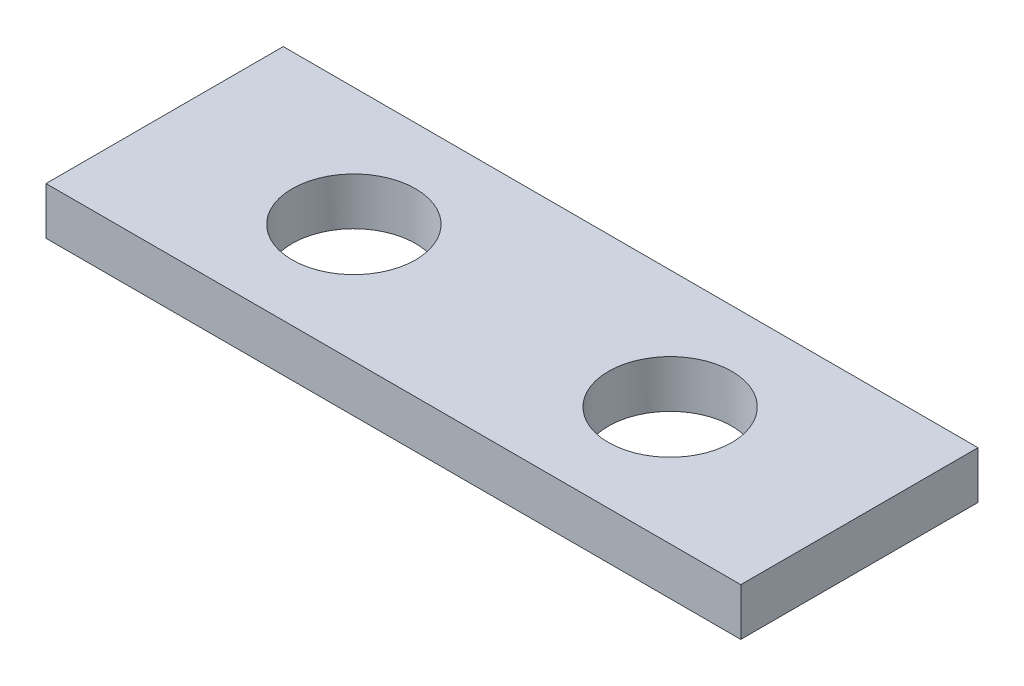
ISO-10303-21;
HEADER;
FILE_DESCRIPTION(('STEP AP214'),'2;1');
FILE_NAME('part.step','',(''),(''),'','','');
FILE_SCHEMA(('AUTOMOTIVE_DESIGN { 1 0 10303 214 1 1 1 1 }'));
ENDSEC;
DATA;
#1=APPLICATION_CONTEXT('core data for automotive mechanical design processes');
#2=APPLICATION_PROTOCOL_DEFINITION('international standard','automotive_design',2000,#1);
#3=PRODUCT_CONTEXT('',#1,'mechanical');
#4=PRODUCT('Part','Part','',(#3));
#5=PRODUCT_RELATED_PRODUCT_CATEGORY('part','',(#4));
#6=PRODUCT_DEFINITION_FORMATION('','',#4);
#7=PRODUCT_DEFINITION_CONTEXT('part definition',#1,'design');
#8=PRODUCT_DEFINITION('design','',#6,#7);
#9=PRODUCT_DEFINITION_SHAPE('','',#8);
#10=(LENGTH_UNIT() NAMED_UNIT(*) SI_UNIT(.MILLI.,.METRE.));
#11=(NAMED_UNIT(*) PLANE_ANGLE_UNIT() SI_UNIT($,.RADIAN.));
#12=(NAMED_UNIT(*) SI_UNIT($,.STERADIAN.) SOLID_ANGLE_UNIT());
#13=UNCERTAINTY_MEASURE_WITH_UNIT(LENGTH_MEASURE(1.E-05),#10,'distance_accuracy_value','');
#14=(GEOMETRIC_REPRESENTATION_CONTEXT(3) GLOBAL_UNCERTAINTY_ASSIGNED_CONTEXT((#13)) GLOBAL_UNIT_ASSIGNED_CONTEXT((#10,
#11,#12)) REPRESENTATION_CONTEXT('',''));
#15=CARTESIAN_POINT('',(0.,0.,0.));
#16=DIRECTION('',(0.,0.,1.));
#17=DIRECTION('',(1.,0.,0.));
#18=AXIS2_PLACEMENT_3D('',#15,#16,#17);
#19=CARTESIAN_POINT('',(21.965,3.,7.5));
#20=DIRECTION('',(-1.,0.,0.));
#21=DIRECTION('',(0.,0.,1.));
#22=AXIS2_PLACEMENT_3D('',#19,#20,#21);
#23=PLANE('',#22);
#24=DIRECTION('',(0.,0.,-1.));
#25=VECTOR('',#24,1.);
#26=CARTESIAN_POINT('',(21.965,0.,7.5));
#27=LINE('',#26,#25);
#28=CARTESIAN_POINT('',(21.965,0.,7.5));
#29=VERTEX_POINT('',#28);
#30=CARTESIAN_POINT('',(21.965,0.,-7.5));
#31=VERTEX_POINT('',#30);
#32=EDGE_CURVE('E96',#29,#31,#27,.T.);
#33=ORIENTED_EDGE('',*,*,#32,.T.);
#34=DIRECTION('',(0.,-1.,0.));
#35=VECTOR('',#34,1.);
#36=CARTESIAN_POINT('',(21.965,3.,-7.5));
#37=LINE('',#36,#35);
#38=CARTESIAN_POINT('',(21.965,3.,-7.5));
#39=VERTEX_POINT('',#38);
#40=EDGE_CURVE('E11',#39,#31,#37,.T.);
#41=ORIENTED_EDGE('',*,*,#40,.F.);
#42=DIRECTION('',(0.,0.,-1.));
#43=VECTOR('',#42,1.);
#44=CARTESIAN_POINT('',(21.965,3.,7.5));
#45=LINE('',#44,#43);
#46=CARTESIAN_POINT('',(21.965,3.,7.5));
#47=VERTEX_POINT('',#46);
#48=EDGE_CURVE('E84',#47,#39,#45,.T.);
#49=ORIENTED_EDGE('',*,*,#48,.F.);
#50=DIRECTION('',(0.,-1.,0.));
#51=VECTOR('',#50,1.);
#52=CARTESIAN_POINT('',(21.965,3.,7.5));
#53=LINE('',#52,#51);
#54=EDGE_CURVE('E92',#47,#29,#53,.T.);
#55=ORIENTED_EDGE('',*,*,#54,.T.);
#56=EDGE_LOOP('',(#33,#41,#49,#55));
#57=FACE_BOUND('',#56,.T.);
#58=ADVANCED_FACE('F33',(#57),#23,.F.);
#59=CARTESIAN_POINT('',(-21.965,3.,-7.5));
#60=DIRECTION('',(0.,0.,1.));
#61=DIRECTION('',(1.,0.,0.));
#62=AXIS2_PLACEMENT_3D('',#59,#60,#61);
#63=PLANE('',#62);
#64=DIRECTION('',(-1.,0.,0.));
#65=VECTOR('',#64,1.);
#66=CARTESIAN_POINT('',(-21.965,0.,-7.5));
#67=LINE('',#66,#65);
#68=CARTESIAN_POINT('',(-21.965,0.,-7.5));
#69=VERTEX_POINT('',#68);
#70=EDGE_CURVE('E88',#31,#69,#67,.T.);
#71=ORIENTED_EDGE('',*,*,#70,.T.);
#72=DIRECTION('',(0.,-1.,0.));
#73=VECTOR('',#72,1.);
#74=CARTESIAN_POINT('',(-21.965,3.,-7.5));
#75=LINE('',#74,#73);
#76=CARTESIAN_POINT('',(-21.965,3.,-7.5));
#77=VERTEX_POINT('',#76);
#78=EDGE_CURVE('E41',#77,#69,#75,.T.);
#79=ORIENTED_EDGE('',*,*,#78,.F.);
#80=DIRECTION('',(-1.,0.,0.));
#81=VECTOR('',#80,1.);
#82=CARTESIAN_POINT('',(-21.965,3.,-7.5));
#83=LINE('',#82,#81);
#84=EDGE_CURVE('E79',#39,#77,#83,.T.);
#85=ORIENTED_EDGE('',*,*,#84,.F.);
#86=ORIENTED_EDGE('',*,*,#40,.T.);
#87=EDGE_LOOP('',(#71,#79,#85,#86));
#88=FACE_BOUND('',#87,.T.);
#89=ADVANCED_FACE('F87',(#88),#63,.F.);
#90=CARTESIAN_POINT('',(-21.965,3.,7.5));
#91=DIRECTION('',(1.,0.,0.));
#92=DIRECTION('',(0.,0.,-1.));
#93=AXIS2_PLACEMENT_3D('',#90,#91,#92);
#94=PLANE('',#93);
#95=DIRECTION('',(0.,0.,1.));
#96=VECTOR('',#95,1.);
#97=CARTESIAN_POINT('',(-21.965,0.,7.5));
#98=LINE('',#97,#96);
#99=CARTESIAN_POINT('',(-21.965,0.,7.5));
#100=VERTEX_POINT('',#99);
#101=EDGE_CURVE('E66',#69,#100,#98,.T.);
#102=ORIENTED_EDGE('',*,*,#101,.T.);
#103=DIRECTION('',(0.,-1.,0.));
#104=VECTOR('',#103,1.);
#105=CARTESIAN_POINT('',(-21.965,3.,7.5));
#106=LINE('',#105,#104);
#107=CARTESIAN_POINT('',(-21.965,3.,7.5));
#108=VERTEX_POINT('',#107);
#109=EDGE_CURVE('E89',#108,#100,#106,.T.);
#110=ORIENTED_EDGE('',*,*,#109,.F.);
#111=DIRECTION('',(0.,0.,1.));
#112=VECTOR('',#111,1.);
#113=CARTESIAN_POINT('',(-21.965,3.,7.5));
#114=LINE('',#113,#112);
#115=EDGE_CURVE('E82',#77,#108,#114,.T.);
#116=ORIENTED_EDGE('',*,*,#115,.F.);
#117=ORIENTED_EDGE('',*,*,#78,.T.);
#118=EDGE_LOOP('',(#102,#110,#116,#117));
#119=FACE_BOUND('',#118,.T.);
#120=ADVANCED_FACE('F90',(#119),#94,.F.);
#121=CARTESIAN_POINT('',(-21.965,3.,7.5));
#122=DIRECTION('',(0.,0.,-1.));
#123=DIRECTION('',(-1.,0.,0.));
#124=AXIS2_PLACEMENT_3D('',#121,#122,#123);
#125=PLANE('',#124);
#126=DIRECTION('',(1.,0.,0.));
#127=VECTOR('',#126,1.);
#128=CARTESIAN_POINT('',(-21.965,0.,7.5));
#129=LINE('',#128,#127);
#130=EDGE_CURVE('E72',#100,#29,#129,.T.);
#131=ORIENTED_EDGE('',*,*,#130,.T.);
#132=ORIENTED_EDGE('',*,*,#54,.F.);
#133=DIRECTION('',(1.,0.,0.));
#134=VECTOR('',#133,1.);
#135=CARTESIAN_POINT('',(-21.965,3.,7.5));
#136=LINE('',#135,#134);
#137=EDGE_CURVE('E49',#108,#47,#136,.T.);
#138=ORIENTED_EDGE('',*,*,#137,.F.);
#139=ORIENTED_EDGE('',*,*,#109,.T.);
#140=EDGE_LOOP('',(#131,#132,#138,#139));
#141=FACE_BOUND('',#140,.T.);
#142=ADVANCED_FACE('F104',(#141),#125,.F.);
#143=CARTESIAN_POINT('',(0.,3.,0.));
#144=DIRECTION('',(0.,-1.,0.));
#145=DIRECTION('',(0.,0.,-1.));
#146=AXIS2_PLACEMENT_3D('',#143,#144,#145);
#147=PLANE('',#146);
#148=CARTESIAN_POINT('',(10.,3.,0.));
#149=DIRECTION('',(0.,-1.,0.));
#150=DIRECTION('',(0.,0.,-1.));
#151=AXIS2_PLACEMENT_3D('',#148,#149,#150);
#152=CIRCLE('',#151,3.9);
#153=CARTESIAN_POINT('',(10.,3.,-3.9));
#154=VERTEX_POINT('',#153);
#155=EDGE_CURVE('E115',#154,#154,#152,.F.);
#156=ORIENTED_EDGE('',*,*,#155,.F.);
#157=EDGE_LOOP('',(#156));
#158=FACE_BOUND('',#157,.T.);
#159=CARTESIAN_POINT('',(-10.,3.,0.));
#160=DIRECTION('',(0.,-1.,0.));
#161=DIRECTION('',(0.,0.,-1.));
#162=AXIS2_PLACEMENT_3D('',#159,#160,#161);
#163=CIRCLE('',#162,3.9);
#164=CARTESIAN_POINT('',(-10.,3.,-3.9));
#165=VERTEX_POINT('',#164);
#166=EDGE_CURVE('E99',#165,#165,#163,.T.);
#167=ORIENTED_EDGE('',*,*,#166,.T.);
#168=EDGE_LOOP('',(#167));
#169=FACE_BOUND('',#168,.T.);
#170=ORIENTED_EDGE('',*,*,#48,.T.);
#171=ORIENTED_EDGE('',*,*,#84,.T.);
#172=ORIENTED_EDGE('',*,*,#115,.T.);
#173=ORIENTED_EDGE('',*,*,#137,.T.);
#174=EDGE_LOOP('',(#170,#171,#172,#173));
#175=FACE_BOUND('',#174,.T.);
#176=ADVANCED_FACE('F80',(#158,#169,#175),#147,.F.);
#177=CARTESIAN_POINT('',(0.,0.,0.));
#178=DIRECTION('',(0.,-1.,0.));
#179=DIRECTION('',(0.,0.,-1.));
#180=AXIS2_PLACEMENT_3D('',#177,#178,#179);
#181=PLANE('',#180);
#182=CARTESIAN_POINT('',(10.,0.,0.));
#183=DIRECTION('',(0.,-1.,0.));
#184=DIRECTION('',(0.,0.,1.));
#185=AXIS2_PLACEMENT_3D('',#182,#183,#184);
#186=CIRCLE('',#185,3.9);
#187=CARTESIAN_POINT('',(10.,0.,3.9));
#188=VERTEX_POINT('',#187);
#189=EDGE_CURVE('E118',#188,#188,#186,.T.);
#190=ORIENTED_EDGE('',*,*,#189,.F.);
#191=EDGE_LOOP('',(#190));
#192=FACE_BOUND('',#191,.T.);
#193=CARTESIAN_POINT('',(-10.,0.,0.));
#194=DIRECTION('',(0.,1.,0.));
#195=DIRECTION('',(0.,0.,1.));
#196=AXIS2_PLACEMENT_3D('',#193,#194,#195);
#197=CIRCLE('',#196,3.9);
#198=CARTESIAN_POINT('',(-10.,0.,3.9));
#199=VERTEX_POINT('',#198);
#200=EDGE_CURVE('E112',#199,#199,#197,.T.);
#201=ORIENTED_EDGE('',*,*,#200,.T.);
#202=EDGE_LOOP('',(#201));
#203=FACE_BOUND('',#202,.T.);
#204=ORIENTED_EDGE('',*,*,#32,.F.);
#205=ORIENTED_EDGE('',*,*,#130,.F.);
#206=ORIENTED_EDGE('',*,*,#101,.F.);
#207=ORIENTED_EDGE('',*,*,#70,.F.);
#208=EDGE_LOOP('',(#204,#205,#206,#207));
#209=FACE_BOUND('',#208,.T.);
#210=ADVANCED_FACE('F107',(#192,#203,#209),#181,.T.);
#211=CARTESIAN_POINT('',(-10.,0.,0.));
#212=DIRECTION('',(0.,1.,0.));
#213=DIRECTION('',(0.,0.,1.));
#214=AXIS2_PLACEMENT_3D('',#211,#212,#213);
#215=CYLINDRICAL_SURFACE('',#214,3.9);
#216=ORIENTED_EDGE('',*,*,#200,.F.);
#217=EDGE_LOOP('',(#216));
#218=FACE_BOUND('',#217,.T.);
#219=ORIENTED_EDGE('',*,*,#166,.F.);
#220=EDGE_LOOP('',(#219));
#221=FACE_BOUND('',#220,.T.);
#222=ADVANCED_FACE('F127',(#218,#221),#215,.F.);
#223=CARTESIAN_POINT('',(10.,0.,0.));
#224=DIRECTION('',(0.,1.,0.));
#225=DIRECTION('',(0.,0.,1.));
#226=AXIS2_PLACEMENT_3D('',#223,#224,#225);
#227=CYLINDRICAL_SURFACE('',#226,3.9);
#228=ORIENTED_EDGE('',*,*,#189,.T.);
#229=EDGE_LOOP('',(#228));
#230=FACE_BOUND('',#229,.T.);
#231=ORIENTED_EDGE('',*,*,#155,.T.);
#232=EDGE_LOOP('',(#231));
#233=FACE_BOUND('',#232,.T.);
#234=ADVANCED_FACE('F122',(#230,#233),#227,.F.);
#235=CLOSED_SHELL('',(#58,#89,#120,#142,#176,#210,#222,#234));
#236=MANIFOLD_SOLID_BREP('B2',#235);
#237=ADVANCED_BREP_SHAPE_REPRESENTATION('',(#18,#236),#14);
#238=SHAPE_DEFINITION_REPRESENTATION(#9,#237);
ENDSEC;
END-ISO-10303-21;
